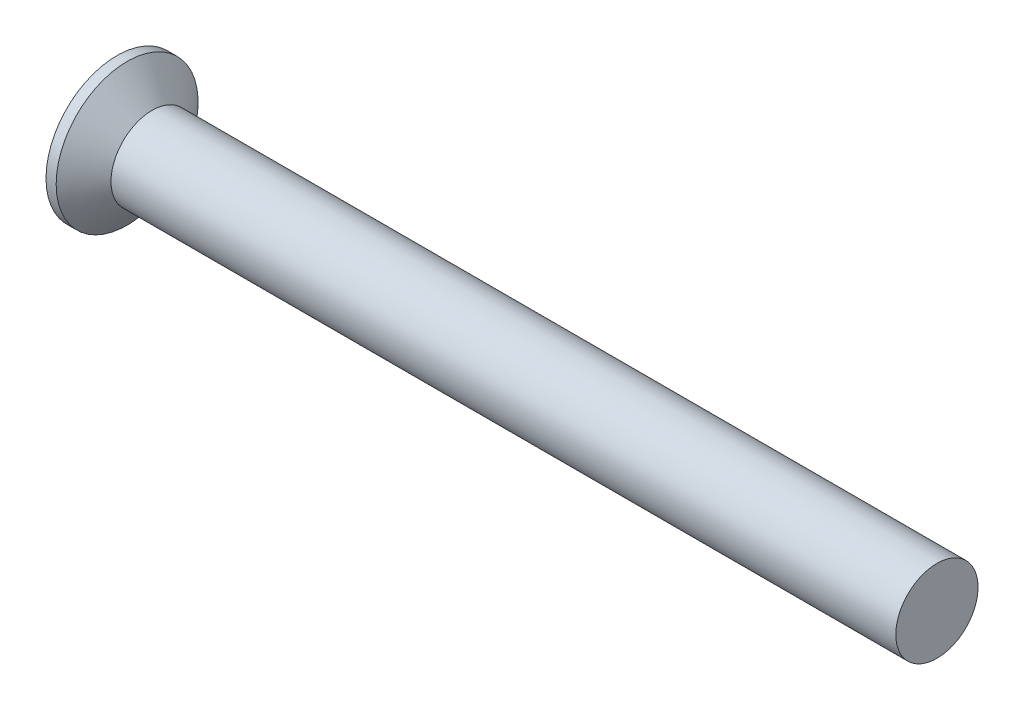
ISO-10303-21;
HEADER;
FILE_DESCRIPTION(('STEP AP214'),'2;1');
FILE_NAME('part.step','',(''),(''),'','','');
FILE_SCHEMA(('AUTOMOTIVE_DESIGN { 1 0 10303 214 1 1 1 1 }'));
ENDSEC;
DATA;
#1=APPLICATION_CONTEXT('core data for automotive mechanical design processes');
#2=APPLICATION_PROTOCOL_DEFINITION('international standard','automotive_design',2000,#1);
#3=PRODUCT_CONTEXT('',#1,'mechanical');
#4=PRODUCT('Part','Part','',(#3));
#5=PRODUCT_RELATED_PRODUCT_CATEGORY('part','',(#4));
#6=PRODUCT_DEFINITION_FORMATION('','',#4);
#7=PRODUCT_DEFINITION_CONTEXT('part definition',#1,'design');
#8=PRODUCT_DEFINITION('design','',#6,#7);
#9=PRODUCT_DEFINITION_SHAPE('','',#8);
#10=(LENGTH_UNIT() NAMED_UNIT(*) SI_UNIT(.MILLI.,.METRE.));
#11=(NAMED_UNIT(*) PLANE_ANGLE_UNIT() SI_UNIT($,.RADIAN.));
#12=(NAMED_UNIT(*) SI_UNIT($,.STERADIAN.) SOLID_ANGLE_UNIT());
#13=UNCERTAINTY_MEASURE_WITH_UNIT(LENGTH_MEASURE(1.E-05),#10,'distance_accuracy_value','');
#14=(GEOMETRIC_REPRESENTATION_CONTEXT(3) GLOBAL_UNCERTAINTY_ASSIGNED_CONTEXT((#13)) GLOBAL_UNIT_ASSIGNED_CONTEXT((#10,
#11,#12)) REPRESENTATION_CONTEXT('',''));
#15=CARTESIAN_POINT('',(0.,0.,0.));
#16=DIRECTION('',(0.,0.,1.));
#17=DIRECTION('',(1.,0.,0.));
#18=AXIS2_PLACEMENT_3D('',#15,#16,#17);
#19=CARTESIAN_POINT('',(0.,0.,0.));
#20=DIRECTION('',(-1.,0.,0.));
#21=DIRECTION('',(0.,0.,1.));
#22=AXIS2_PLACEMENT_3D('',#19,#20,#21);
#23=PLANE('',#22);
#24=CARTESIAN_POINT('',(0.,0.,0.));
#25=DIRECTION('',(-1.,0.,0.));
#26=DIRECTION('',(0.,0.,1.));
#27=AXIS2_PLACEMENT_3D('',#24,#25,#26);
#28=CIRCLE('',#27,3.0226);
#29=CARTESIAN_POINT('',(0.,0.,3.0226));
#30=VERTEX_POINT('',#29);
#31=EDGE_CURVE('E10',#30,#30,#28,.T.);
#32=ORIENTED_EDGE('',*,*,#31,.T.);
#33=EDGE_LOOP('',(#32));
#34=FACE_BOUND('',#33,.T.);
#35=ADVANCED_FACE('F31',(#34),#23,.T.);
#36=CARTESIAN_POINT('',(-6.34999999999999,0.,0.));
#37=DIRECTION('',(-1.,0.,0.));
#38=DIRECTION('',(0.,0.,1.));
#39=AXIS2_PLACEMENT_3D('',#36,#37,#38);
#40=CYLINDRICAL_SURFACE('',#39,3.0226);
#41=CARTESIAN_POINT('',(0.432943468404858,0.,0.));
#42=DIRECTION('',(-1.,0.,0.));
#43=DIRECTION('',(0.,0.,1.));
#44=AXIS2_PLACEMENT_3D('',#41,#42,#43);
#45=CIRCLE('',#44,3.0226);
#46=CARTESIAN_POINT('',(0.432943468404858,0.,3.0226));
#47=VERTEX_POINT('',#46);
#48=EDGE_CURVE('E37',#47,#47,#45,.T.);
#49=ORIENTED_EDGE('',*,*,#48,.T.);
#50=EDGE_LOOP('',(#49));
#51=FACE_BOUND('',#50,.T.);
#52=ORIENTED_EDGE('',*,*,#31,.F.);
#53=EDGE_LOOP('',(#52));
#54=FACE_BOUND('',#53,.T.);
#55=ADVANCED_FACE('F63',(#51,#54),#40,.T.);
#56=CARTESIAN_POINT('',(0.432943468404858,0.,0.));
#57=DIRECTION('',(-1.,0.,0.));
#58=DIRECTION('',(0.,0.,1.));
#59=AXIS2_PLACEMENT_3D('',#56,#57,#58);
#60=CONICAL_SURFACE('',#59,3.0226,0.872664625997167);
#61=CARTESIAN_POINT('',(1.4986,0.,0.));
#62=DIRECTION('',(-1.,0.,0.));
#63=DIRECTION('',(0.,0.,1.));
#64=AXIS2_PLACEMENT_3D('',#61,#62,#63);
#65=CIRCLE('',#64,1.7526);
#66=CARTESIAN_POINT('',(1.4986,0.,1.7526));
#67=VERTEX_POINT('',#66);
#68=EDGE_CURVE('E41',#67,#67,#65,.T.);
#69=ORIENTED_EDGE('',*,*,#68,.T.);
#70=EDGE_LOOP('',(#69));
#71=FACE_BOUND('',#70,.T.);
#72=ORIENTED_EDGE('',*,*,#48,.F.);
#73=EDGE_LOOP('',(#72));
#74=FACE_BOUND('',#73,.T.);
#75=ADVANCED_FACE('F60',(#71,#74),#60,.T.);
#76=CARTESIAN_POINT('',(-6.34999999999999,0.,0.));
#77=DIRECTION('',(-1.,0.,0.));
#78=DIRECTION('',(0.,0.,1.));
#79=AXIS2_PLACEMENT_3D('',#76,#77,#78);
#80=CYLINDRICAL_SURFACE('',#79,1.7526);
#81=CARTESIAN_POINT('',(34.925,0.,0.));
#82=DIRECTION('',(-1.,0.,0.));
#83=DIRECTION('',(0.,0.,1.));
#84=AXIS2_PLACEMENT_3D('',#81,#82,#83);
#85=CIRCLE('',#84,1.7526);
#86=CARTESIAN_POINT('',(34.925,0.,1.7526));
#87=VERTEX_POINT('',#86);
#88=EDGE_CURVE('E45',#87,#87,#85,.T.);
#89=ORIENTED_EDGE('',*,*,#88,.T.);
#90=EDGE_LOOP('',(#89));
#91=FACE_BOUND('',#90,.T.);
#92=ORIENTED_EDGE('',*,*,#68,.F.);
#93=EDGE_LOOP('',(#92));
#94=FACE_BOUND('',#93,.T.);
#95=ADVANCED_FACE('F51',(#91,#94),#80,.T.);
#96=CARTESIAN_POINT('',(34.925,1.7526,0.));
#97=DIRECTION('',(1.,0.,0.));
#98=DIRECTION('',(0.,0.,-1.));
#99=AXIS2_PLACEMENT_3D('',#96,#97,#98);
#100=PLANE('',#99);
#101=ORIENTED_EDGE('',*,*,#88,.F.);
#102=EDGE_LOOP('',(#101));
#103=FACE_BOUND('',#102,.T.);
#104=ADVANCED_FACE('F54',(#103),#100,.T.);
#105=CLOSED_SHELL('',(#35,#55,#75,#95,#104));
#106=MANIFOLD_SOLID_BREP('B2',#105);
#107=ADVANCED_BREP_SHAPE_REPRESENTATION('',(#18,#106),#14);
#108=SHAPE_DEFINITION_REPRESENTATION(#9,#107);
ENDSEC;
END-ISO-10303-21;
